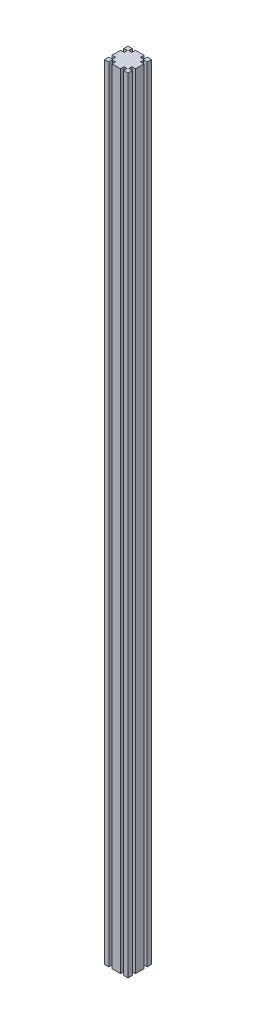
ISO-10303-21;
HEADER;
FILE_DESCRIPTION(('STEP AP214'),'2;1');
FILE_NAME('part.step','',(''),(''),'','','');
FILE_SCHEMA(('AUTOMOTIVE_DESIGN { 1 0 10303 214 1 1 1 1 }'));
ENDSEC;
DATA;
#1=APPLICATION_CONTEXT('core data for automotive mechanical design processes');
#2=APPLICATION_PROTOCOL_DEFINITION('international standard','automotive_design',2000,#1);
#3=PRODUCT_CONTEXT('',#1,'mechanical');
#4=PRODUCT('Part','Part','',(#3));
#5=PRODUCT_RELATED_PRODUCT_CATEGORY('part','',(#4));
#6=PRODUCT_DEFINITION_FORMATION('','',#4);
#7=PRODUCT_DEFINITION_CONTEXT('part definition',#1,'design');
#8=PRODUCT_DEFINITION('design','',#6,#7);
#9=PRODUCT_DEFINITION_SHAPE('','',#8);
#10=(LENGTH_UNIT() NAMED_UNIT(*) SI_UNIT(.MILLI.,.METRE.));
#11=(NAMED_UNIT(*) PLANE_ANGLE_UNIT() SI_UNIT($,.RADIAN.));
#12=(NAMED_UNIT(*) SI_UNIT($,.STERADIAN.) SOLID_ANGLE_UNIT());
#13=UNCERTAINTY_MEASURE_WITH_UNIT(LENGTH_MEASURE(1.E-05),#10,'distance_accuracy_value','');
#14=(GEOMETRIC_REPRESENTATION_CONTEXT(3) GLOBAL_UNCERTAINTY_ASSIGNED_CONTEXT((#13)) GLOBAL_UNIT_ASSIGNED_CONTEXT((#10,
#11,#12)) REPRESENTATION_CONTEXT('',''));
#15=CARTESIAN_POINT('',(0.,0.,0.));
#16=DIRECTION('',(0.,0.,1.));
#17=DIRECTION('',(1.,0.,0.));
#18=AXIS2_PLACEMENT_3D('',#15,#16,#17);
#19=CARTESIAN_POINT('',(0.,2000.,0.));
#20=DIRECTION('',(-1.,0.,0.));
#21=DIRECTION('',(0.,0.,1.));
#22=AXIS2_PLACEMENT_3D('',#19,#20,#21);
#23=PLANE('',#22);
#24=DIRECTION('',(0.,0.,-1.));
#25=VECTOR('',#24,1.);
#26=CARTESIAN_POINT('',(0.,0.,0.));
#27=LINE('',#26,#25);
#28=CARTESIAN_POINT('',(0.,0.,-19.1));
#29=VERTEX_POINT('',#28);
#30=CARTESIAN_POINT('',(0.,0.,-40.9));
#31=VERTEX_POINT('',#30);
#32=EDGE_CURVE('E307',#29,#31,#27,.T.);
#33=ORIENTED_EDGE('',*,*,#32,.F.);
#34=DIRECTION('',(0.,-1.,0.));
#35=VECTOR('',#34,1.);
#36=CARTESIAN_POINT('',(0.,2000.,-19.1));
#37=LINE('',#36,#35);
#38=CARTESIAN_POINT('',(0.,2000.,-19.1));
#39=VERTEX_POINT('',#38);
#40=EDGE_CURVE('E11',#39,#29,#37,.T.);
#41=ORIENTED_EDGE('',*,*,#40,.F.);
#42=DIRECTION('',(0.,0.,-1.));
#43=VECTOR('',#42,1.);
#44=CARTESIAN_POINT('',(0.,2000.,0.));
#45=LINE('',#44,#43);
#46=CARTESIAN_POINT('',(0.,2000.,-40.9));
#47=VERTEX_POINT('',#46);
#48=EDGE_CURVE('E427',#39,#47,#45,.T.);
#49=ORIENTED_EDGE('',*,*,#48,.T.);
#50=DIRECTION('',(0.,-1.,0.));
#51=VECTOR('',#50,1.);
#52=CARTESIAN_POINT('',(0.,2000.,-40.9));
#53=LINE('',#52,#51);
#54=EDGE_CURVE('E178',#47,#31,#53,.T.);
#55=ORIENTED_EDGE('',*,*,#54,.T.);
#56=EDGE_LOOP('',(#33,#41,#49,#55));
#57=FACE_BOUND('',#56,.T.);
#58=ADVANCED_FACE('F41',(#57),#23,.T.);
#59=CARTESIAN_POINT('',(0.,2000.,-19.1));
#60=DIRECTION('',(0.,0.,1.));
#61=DIRECTION('',(1.,0.,0.));
#62=AXIS2_PLACEMENT_3D('',#59,#60,#61);
#63=PLANE('',#62);
#64=DIRECTION('',(-1.,0.,0.));
#65=VECTOR('',#64,1.);
#66=CARTESIAN_POINT('',(0.,0.,-19.1));
#67=LINE('',#66,#65);
#68=CARTESIAN_POINT('',(9.2,0.,-19.1));
#69=VERTEX_POINT('',#68);
#70=EDGE_CURVE('E311',#69,#29,#67,.T.);
#71=ORIENTED_EDGE('',*,*,#70,.F.);
#72=DIRECTION('',(0.,-1.,0.));
#73=VECTOR('',#72,1.);
#74=CARTESIAN_POINT('',(9.2,2000.,-19.1));
#75=LINE('',#74,#73);
#76=CARTESIAN_POINT('',(9.2,2000.,-19.1));
#77=VERTEX_POINT('',#76);
#78=EDGE_CURVE('E51',#77,#69,#75,.T.);
#79=ORIENTED_EDGE('',*,*,#78,.F.);
#80=DIRECTION('',(-1.,0.,0.));
#81=VECTOR('',#80,1.);
#82=CARTESIAN_POINT('',(0.,2000.,-19.1));
#83=LINE('',#82,#81);
#84=EDGE_CURVE('E557',#77,#39,#83,.T.);
#85=ORIENTED_EDGE('',*,*,#84,.T.);
#86=ORIENTED_EDGE('',*,*,#40,.T.);
#87=EDGE_LOOP('',(#71,#79,#85,#86));
#88=FACE_BOUND('',#87,.T.);
#89=ADVANCED_FACE('F43',(#88),#63,.T.);
#90=CARTESIAN_POINT('',(9.2,2000.,0.));
#91=DIRECTION('',(-1.,0.,0.));
#92=DIRECTION('',(0.,0.,1.));
#93=AXIS2_PLACEMENT_3D('',#90,#91,#92);
#94=PLANE('',#93);
#95=DIRECTION('',(0.,0.,-1.));
#96=VECTOR('',#95,1.);
#97=CARTESIAN_POINT('',(9.2,0.,0.));
#98=LINE('',#97,#96);
#99=CARTESIAN_POINT('',(9.2,0.,-10.9));
#100=VERTEX_POINT('',#99);
#101=EDGE_CURVE('E316',#100,#69,#98,.T.);
#102=ORIENTED_EDGE('',*,*,#101,.F.);
#103=DIRECTION('',(0.,-1.,0.));
#104=VECTOR('',#103,1.);
#105=CARTESIAN_POINT('',(9.2,2000.,-10.9));
#106=LINE('',#105,#104);
#107=CARTESIAN_POINT('',(9.2,2000.,-10.9));
#108=VERTEX_POINT('',#107);
#109=EDGE_CURVE('E532',#108,#100,#106,.T.);
#110=ORIENTED_EDGE('',*,*,#109,.F.);
#111=DIRECTION('',(0.,0.,-1.));
#112=VECTOR('',#111,1.);
#113=CARTESIAN_POINT('',(9.2,2000.,0.));
#114=LINE('',#113,#112);
#115=EDGE_CURVE('E541',#108,#77,#114,.T.);
#116=ORIENTED_EDGE('',*,*,#115,.T.);
#117=ORIENTED_EDGE('',*,*,#78,.T.);
#118=EDGE_LOOP('',(#102,#110,#116,#117));
#119=FACE_BOUND('',#118,.T.);
#120=ADVANCED_FACE('F539',(#119),#94,.T.);
#121=CARTESIAN_POINT('',(0.,2000.,-10.9));
#122=DIRECTION('',(0.,0.,-1.));
#123=DIRECTION('',(-1.,0.,0.));
#124=AXIS2_PLACEMENT_3D('',#121,#122,#123);
#125=PLANE('',#124);
#126=DIRECTION('',(1.,0.,0.));
#127=VECTOR('',#126,1.);
#128=CARTESIAN_POINT('',(0.,0.,-10.9));
#129=LINE('',#128,#127);
#130=CARTESIAN_POINT('',(0.,0.,-10.9));
#131=VERTEX_POINT('',#130);
#132=EDGE_CURVE('E320',#131,#100,#129,.T.);
#133=ORIENTED_EDGE('',*,*,#132,.F.);
#134=DIRECTION('',(0.,-1.,0.));
#135=VECTOR('',#134,1.);
#136=CARTESIAN_POINT('',(0.,2000.,-10.9));
#137=LINE('',#136,#135);
#138=CARTESIAN_POINT('',(0.,2000.,-10.9));
#139=VERTEX_POINT('',#138);
#140=EDGE_CURVE('E529',#139,#131,#137,.T.);
#141=ORIENTED_EDGE('',*,*,#140,.F.);
#142=DIRECTION('',(1.,0.,0.));
#143=VECTOR('',#142,1.);
#144=CARTESIAN_POINT('',(0.,2000.,-10.9));
#145=LINE('',#144,#143);
#146=EDGE_CURVE('E554',#139,#108,#145,.T.);
#147=ORIENTED_EDGE('',*,*,#146,.T.);
#148=ORIENTED_EDGE('',*,*,#109,.T.);
#149=EDGE_LOOP('',(#133,#141,#147,#148));
#150=FACE_BOUND('',#149,.T.);
#151=ADVANCED_FACE('F551',(#150),#125,.T.);
#152=CARTESIAN_POINT('',(0.,2000.,0.));
#153=DIRECTION('',(-1.,0.,0.));
#154=DIRECTION('',(0.,0.,1.));
#155=AXIS2_PLACEMENT_3D('',#152,#153,#154);
#156=PLANE('',#155);
#157=DIRECTION('',(0.,0.,-1.));
#158=VECTOR('',#157,1.);
#159=CARTESIAN_POINT('',(0.,0.,0.));
#160=LINE('',#159,#158);
#161=CARTESIAN_POINT('',(0.,0.,0.));
#162=VERTEX_POINT('',#161);
#163=EDGE_CURVE('E324',#162,#131,#160,.T.);
#164=ORIENTED_EDGE('',*,*,#163,.F.);
#165=DIRECTION('',(0.,-1.,0.));
#166=VECTOR('',#165,1.);
#167=CARTESIAN_POINT('',(0.,2000.,0.));
#168=LINE('',#167,#166);
#169=CARTESIAN_POINT('',(0.,2000.,0.));
#170=VERTEX_POINT('',#169);
#171=EDGE_CURVE('E526',#170,#162,#168,.T.);
#172=ORIENTED_EDGE('',*,*,#171,.F.);
#173=DIRECTION('',(0.,0.,-1.));
#174=VECTOR('',#173,1.);
#175=CARTESIAN_POINT('',(0.,2000.,0.));
#176=LINE('',#175,#174);
#177=EDGE_CURVE('E562',#170,#139,#176,.T.);
#178=ORIENTED_EDGE('',*,*,#177,.T.);
#179=ORIENTED_EDGE('',*,*,#140,.T.);
#180=EDGE_LOOP('',(#164,#172,#178,#179));
#181=FACE_BOUND('',#180,.T.);
#182=ADVANCED_FACE('F813',(#181),#156,.T.);
#183=CARTESIAN_POINT('',(0.,2000.,0.));
#184=DIRECTION('',(0.,0.,-1.));
#185=DIRECTION('',(-1.,0.,0.));
#186=AXIS2_PLACEMENT_3D('',#183,#184,#185);
#187=PLANE('',#186);
#188=DIRECTION('',(1.,0.,0.));
#189=VECTOR('',#188,1.);
#190=CARTESIAN_POINT('',(0.,0.,0.));
#191=LINE('',#190,#189);
#192=CARTESIAN_POINT('',(10.9,0.,0.));
#193=VERTEX_POINT('',#192);
#194=EDGE_CURVE('E328',#162,#193,#191,.T.);
#195=ORIENTED_EDGE('',*,*,#194,.T.);
#196=DIRECTION('',(0.,-1.,0.));
#197=VECTOR('',#196,1.);
#198=CARTESIAN_POINT('',(10.9,2000.,0.));
#199=LINE('',#198,#197);
#200=CARTESIAN_POINT('',(10.9,2000.,0.));
#201=VERTEX_POINT('',#200);
#202=EDGE_CURVE('E522',#201,#193,#199,.T.);
#203=ORIENTED_EDGE('',*,*,#202,.F.);
#204=DIRECTION('',(1.,0.,0.));
#205=VECTOR('',#204,1.);
#206=CARTESIAN_POINT('',(0.,2000.,0.));
#207=LINE('',#206,#205);
#208=EDGE_CURVE('E569',#170,#201,#207,.T.);
#209=ORIENTED_EDGE('',*,*,#208,.F.);
#210=ORIENTED_EDGE('',*,*,#171,.T.);
#211=EDGE_LOOP('',(#195,#203,#209,#210));
#212=FACE_BOUND('',#211,.T.);
#213=ADVANCED_FACE('F809',(#212),#187,.F.);
#214=CARTESIAN_POINT('',(10.9,2000.,0.));
#215=DIRECTION('',(-1.,0.,0.));
#216=DIRECTION('',(0.,0.,1.));
#217=AXIS2_PLACEMENT_3D('',#214,#215,#216);
#218=PLANE('',#217);
#219=DIRECTION('',(0.,0.,-1.));
#220=VECTOR('',#219,1.);
#221=CARTESIAN_POINT('',(10.9,0.,0.));
#222=LINE('',#221,#220);
#223=CARTESIAN_POINT('',(10.9,0.,-9.2));
#224=VERTEX_POINT('',#223);
#225=EDGE_CURVE('E331',#193,#224,#222,.T.);
#226=ORIENTED_EDGE('',*,*,#225,.T.);
#227=DIRECTION('',(0.,-1.,0.));
#228=VECTOR('',#227,1.);
#229=CARTESIAN_POINT('',(10.9,2000.,-9.2));
#230=LINE('',#229,#228);
#231=CARTESIAN_POINT('',(10.9,2000.,-9.2));
#232=VERTEX_POINT('',#231);
#233=EDGE_CURVE('E518',#232,#224,#230,.T.);
#234=ORIENTED_EDGE('',*,*,#233,.F.);
#235=DIRECTION('',(0.,0.,-1.));
#236=VECTOR('',#235,1.);
#237=CARTESIAN_POINT('',(10.9,2000.,0.));
#238=LINE('',#237,#236);
#239=EDGE_CURVE('E572',#201,#232,#238,.T.);
#240=ORIENTED_EDGE('',*,*,#239,.F.);
#241=ORIENTED_EDGE('',*,*,#202,.T.);
#242=EDGE_LOOP('',(#226,#234,#240,#241));
#243=FACE_BOUND('',#242,.T.);
#244=ADVANCED_FACE('F805',(#243),#218,.F.);
#245=CARTESIAN_POINT('',(0.,2000.,-9.19999999999999));
#246=DIRECTION('',(0.,0.,-1.));
#247=DIRECTION('',(-1.,0.,0.));
#248=AXIS2_PLACEMENT_3D('',#245,#246,#247);
#249=PLANE('',#248);
#250=DIRECTION('',(1.,0.,0.));
#251=VECTOR('',#250,1.);
#252=CARTESIAN_POINT('',(0.,0.,-9.19999999999999));
#253=LINE('',#252,#251);
#254=CARTESIAN_POINT('',(19.1,0.,-9.20000000000001));
#255=VERTEX_POINT('',#254);
#256=EDGE_CURVE('E334',#224,#255,#253,.T.);
#257=ORIENTED_EDGE('',*,*,#256,.T.);
#258=DIRECTION('',(0.,-1.,0.));
#259=VECTOR('',#258,1.);
#260=CARTESIAN_POINT('',(19.1,2000.,-9.20000000000001));
#261=LINE('',#260,#259);
#262=CARTESIAN_POINT('',(19.1,2000.,-9.20000000000001));
#263=VERTEX_POINT('',#262);
#264=EDGE_CURVE('E514',#263,#255,#261,.T.);
#265=ORIENTED_EDGE('',*,*,#264,.F.);
#266=DIRECTION('',(1.,0.,0.));
#267=VECTOR('',#266,1.);
#268=CARTESIAN_POINT('',(0.,2000.,-9.19999999999999));
#269=LINE('',#268,#267);
#270=EDGE_CURVE('E575',#232,#263,#269,.T.);
#271=ORIENTED_EDGE('',*,*,#270,.F.);
#272=ORIENTED_EDGE('',*,*,#233,.T.);
#273=EDGE_LOOP('',(#257,#265,#271,#272));
#274=FACE_BOUND('',#273,.T.);
#275=ADVANCED_FACE('F801',(#274),#249,.F.);
#276=CARTESIAN_POINT('',(19.1,2000.,0.));
#277=DIRECTION('',(1.,0.,0.));
#278=DIRECTION('',(0.,0.,-1.));
#279=AXIS2_PLACEMENT_3D('',#276,#277,#278);
#280=PLANE('',#279);
#281=DIRECTION('',(0.,0.,1.));
#282=VECTOR('',#281,1.);
#283=CARTESIAN_POINT('',(19.1,0.,0.));
#284=LINE('',#283,#282);
#285=CARTESIAN_POINT('',(19.1,0.,0.));
#286=VERTEX_POINT('',#285);
#287=EDGE_CURVE('E337',#255,#286,#284,.T.);
#288=ORIENTED_EDGE('',*,*,#287,.T.);
#289=DIRECTION('',(0.,-1.,0.));
#290=VECTOR('',#289,1.);
#291=CARTESIAN_POINT('',(19.1,2000.,0.));
#292=LINE('',#291,#290);
#293=CARTESIAN_POINT('',(19.1,2000.,0.));
#294=VERTEX_POINT('',#293);
#295=EDGE_CURVE('E510',#294,#286,#292,.T.);
#296=ORIENTED_EDGE('',*,*,#295,.F.);
#297=DIRECTION('',(0.,0.,1.));
#298=VECTOR('',#297,1.);
#299=CARTESIAN_POINT('',(19.1,2000.,0.));
#300=LINE('',#299,#298);
#301=EDGE_CURVE('E578',#263,#294,#300,.T.);
#302=ORIENTED_EDGE('',*,*,#301,.F.);
#303=ORIENTED_EDGE('',*,*,#264,.T.);
#304=EDGE_LOOP('',(#288,#296,#302,#303));
#305=FACE_BOUND('',#304,.T.);
#306=ADVANCED_FACE('F798',(#305),#280,.F.);
#307=CARTESIAN_POINT('',(0.,2000.,0.));
#308=DIRECTION('',(0.,0.,-1.));
#309=DIRECTION('',(-1.,0.,0.));
#310=AXIS2_PLACEMENT_3D('',#307,#308,#309);
#311=PLANE('',#310);
#312=DIRECTION('',(1.,0.,0.));
#313=VECTOR('',#312,1.);
#314=CARTESIAN_POINT('',(0.,0.,0.));
#315=LINE('',#314,#313);
#316=CARTESIAN_POINT('',(40.9,0.,0.));
#317=VERTEX_POINT('',#316);
#318=EDGE_CURVE('E340',#286,#317,#315,.T.);
#319=ORIENTED_EDGE('',*,*,#318,.T.);
#320=DIRECTION('',(0.,-1.,0.));
#321=VECTOR('',#320,1.);
#322=CARTESIAN_POINT('',(40.9,2000.,0.));
#323=LINE('',#322,#321);
#324=CARTESIAN_POINT('',(40.9,2000.,0.));
#325=VERTEX_POINT('',#324);
#326=EDGE_CURVE('E507',#325,#317,#323,.T.);
#327=ORIENTED_EDGE('',*,*,#326,.F.);
#328=DIRECTION('',(1.,0.,0.));
#329=VECTOR('',#328,1.);
#330=CARTESIAN_POINT('',(0.,2000.,0.));
#331=LINE('',#330,#329);
#332=EDGE_CURVE('E581',#294,#325,#331,.T.);
#333=ORIENTED_EDGE('',*,*,#332,.F.);
#334=ORIENTED_EDGE('',*,*,#295,.T.);
#335=EDGE_LOOP('',(#319,#327,#333,#334));
#336=FACE_BOUND('',#335,.T.);
#337=ADVANCED_FACE('F786',(#336),#311,.F.);
#338=CARTESIAN_POINT('',(40.9,2000.,0.));
#339=DIRECTION('',(1.,0.,0.));
#340=DIRECTION('',(0.,0.,-1.));
#341=AXIS2_PLACEMENT_3D('',#338,#339,#340);
#342=PLANE('',#341);
#343=DIRECTION('',(0.,0.,1.));
#344=VECTOR('',#343,1.);
#345=CARTESIAN_POINT('',(40.9,0.,0.));
#346=LINE('',#345,#344);
#347=CARTESIAN_POINT('',(40.9,0.,-9.20000000000001));
#348=VERTEX_POINT('',#347);
#349=EDGE_CURVE('E344',#348,#317,#346,.T.);
#350=ORIENTED_EDGE('',*,*,#349,.F.);
#351=DIRECTION('',(0.,-1.,0.));
#352=VECTOR('',#351,1.);
#353=CARTESIAN_POINT('',(40.9,2000.,-9.20000000000001));
#354=LINE('',#353,#352);
#355=CARTESIAN_POINT('',(40.9,2000.,-9.20000000000001));
#356=VERTEX_POINT('',#355);
#357=EDGE_CURVE('E504',#356,#348,#354,.T.);
#358=ORIENTED_EDGE('',*,*,#357,.F.);
#359=DIRECTION('',(0.,0.,1.));
#360=VECTOR('',#359,1.);
#361=CARTESIAN_POINT('',(40.9,2000.,0.));
#362=LINE('',#361,#360);
#363=EDGE_CURVE('E584',#356,#325,#362,.T.);
#364=ORIENTED_EDGE('',*,*,#363,.T.);
#365=ORIENTED_EDGE('',*,*,#326,.T.);
#366=EDGE_LOOP('',(#350,#358,#364,#365));
#367=FACE_BOUND('',#366,.T.);
#368=ADVANCED_FACE('F793',(#367),#342,.T.);
#369=CARTESIAN_POINT('',(0.,2000.,-9.19999999999997));
#370=DIRECTION('',(0.,0.,1.));
#371=DIRECTION('',(1.,0.,0.));
#372=AXIS2_PLACEMENT_3D('',#369,#370,#371);
#373=PLANE('',#372);
#374=DIRECTION('',(-1.,0.,0.));
#375=VECTOR('',#374,1.);
#376=CARTESIAN_POINT('',(0.,0.,-9.19999999999997));
#377=LINE('',#376,#375);
#378=CARTESIAN_POINT('',(49.1,0.,-9.20000000000001));
#379=VERTEX_POINT('',#378);
#380=EDGE_CURVE('E349',#379,#348,#377,.T.);
#381=ORIENTED_EDGE('',*,*,#380,.F.);
#382=DIRECTION('',(0.,-1.,0.));
#383=VECTOR('',#382,1.);
#384=CARTESIAN_POINT('',(49.1,2000.,-9.20000000000001));
#385=LINE('',#384,#383);
#386=CARTESIAN_POINT('',(49.1,2000.,-9.20000000000001));
#387=VERTEX_POINT('',#386);
#388=EDGE_CURVE('E501',#387,#379,#385,.T.);
#389=ORIENTED_EDGE('',*,*,#388,.F.);
#390=DIRECTION('',(-1.,0.,0.));
#391=VECTOR('',#390,1.);
#392=CARTESIAN_POINT('',(0.,2000.,-9.19999999999997));
#393=LINE('',#392,#391);
#394=EDGE_CURVE('E589',#387,#356,#393,.T.);
#395=ORIENTED_EDGE('',*,*,#394,.T.);
#396=ORIENTED_EDGE('',*,*,#357,.T.);
#397=EDGE_LOOP('',(#381,#389,#395,#396));
#398=FACE_BOUND('',#397,.T.);
#399=ADVANCED_FACE('F789',(#398),#373,.T.);
#400=CARTESIAN_POINT('',(49.1,2000.,0.));
#401=DIRECTION('',(-1.,0.,0.));
#402=DIRECTION('',(0.,0.,1.));
#403=AXIS2_PLACEMENT_3D('',#400,#401,#402);
#404=PLANE('',#403);
#405=DIRECTION('',(0.,0.,-1.));
#406=VECTOR('',#405,1.);
#407=CARTESIAN_POINT('',(49.1,0.,0.));
#408=LINE('',#407,#406);
#409=CARTESIAN_POINT('',(49.1,0.,0.));
#410=VERTEX_POINT('',#409);
#411=EDGE_CURVE('E353',#410,#379,#408,.T.);
#412=ORIENTED_EDGE('',*,*,#411,.F.);
#413=DIRECTION('',(0.,-1.,0.));
#414=VECTOR('',#413,1.);
#415=CARTESIAN_POINT('',(49.1,2000.,0.));
#416=LINE('',#415,#414);
#417=CARTESIAN_POINT('',(49.1,2000.,0.));
#418=VERTEX_POINT('',#417);
#419=EDGE_CURVE('E498',#418,#410,#416,.T.);
#420=ORIENTED_EDGE('',*,*,#419,.F.);
#421=DIRECTION('',(0.,0.,-1.));
#422=VECTOR('',#421,1.);
#423=CARTESIAN_POINT('',(49.1,2000.,0.));
#424=LINE('',#423,#422);
#425=EDGE_CURVE('E593',#418,#387,#424,.T.);
#426=ORIENTED_EDGE('',*,*,#425,.T.);
#427=ORIENTED_EDGE('',*,*,#388,.T.);
#428=EDGE_LOOP('',(#412,#420,#426,#427));
#429=FACE_BOUND('',#428,.T.);
#430=ADVANCED_FACE('F785',(#429),#404,.T.);
#431=CARTESIAN_POINT('',(60.,0.,0.));
#432=VERTEX_POINT('',#431);
#433=EDGE_CURVE('E345',#410,#432,#315,.T.);
#434=ORIENTED_EDGE('',*,*,#433,.T.);
#435=DIRECTION('',(0.,-1.,0.));
#436=VECTOR('',#435,1.);
#437=CARTESIAN_POINT('',(60.,2000.,0.));
#438=LINE('',#437,#436);
#439=CARTESIAN_POINT('',(60.,2000.,0.));
#440=VERTEX_POINT('',#439);
#441=EDGE_CURVE('E494',#440,#432,#438,.T.);
#442=ORIENTED_EDGE('',*,*,#441,.F.);
#443=EDGE_CURVE('E585',#418,#440,#331,.T.);
#444=ORIENTED_EDGE('',*,*,#443,.F.);
#445=ORIENTED_EDGE('',*,*,#419,.T.);
#446=EDGE_LOOP('',(#434,#442,#444,#445));
#447=FACE_BOUND('',#446,.T.);
#448=ADVANCED_FACE('F685',(#447),#311,.F.);
#449=CARTESIAN_POINT('',(60.,2000.,0.));
#450=DIRECTION('',(-1.,0.,0.));
#451=DIRECTION('',(0.,0.,1.));
#452=AXIS2_PLACEMENT_3D('',#449,#450,#451);
#453=PLANE('',#452);
#454=DIRECTION('',(0.,0.,-1.));
#455=VECTOR('',#454,1.);
#456=CARTESIAN_POINT('',(60.,0.,0.));
#457=LINE('',#456,#455);
#458=CARTESIAN_POINT('',(60.,0.,-10.9));
#459=VERTEX_POINT('',#458);
#460=EDGE_CURVE('E357',#432,#459,#457,.T.);
#461=ORIENTED_EDGE('',*,*,#460,.T.);
#462=DIRECTION('',(0.,-1.,0.));
#463=VECTOR('',#462,1.);
#464=CARTESIAN_POINT('',(60.,2000.,-10.9));
#465=LINE('',#464,#463);
#466=CARTESIAN_POINT('',(60.,2000.,-10.9));
#467=VERTEX_POINT('',#466);
#468=EDGE_CURVE('E490',#467,#459,#465,.T.);
#469=ORIENTED_EDGE('',*,*,#468,.F.);
#470=DIRECTION('',(0.,0.,-1.));
#471=VECTOR('',#470,1.);
#472=CARTESIAN_POINT('',(60.,2000.,0.));
#473=LINE('',#472,#471);
#474=EDGE_CURVE('E597',#440,#467,#473,.T.);
#475=ORIENTED_EDGE('',*,*,#474,.F.);
#476=ORIENTED_EDGE('',*,*,#441,.T.);
#477=EDGE_LOOP('',(#461,#469,#475,#476));
#478=FACE_BOUND('',#477,.T.);
#479=ADVANCED_FACE('F691',(#478),#453,.F.);
#480=CARTESIAN_POINT('',(0.,2000.,-10.9));
#481=DIRECTION('',(0.,0.,1.));
#482=DIRECTION('',(1.,0.,0.));
#483=AXIS2_PLACEMENT_3D('',#480,#481,#482);
#484=PLANE('',#483);
#485=DIRECTION('',(-1.,0.,0.));
#486=VECTOR('',#485,1.);
#487=CARTESIAN_POINT('',(0.,0.,-10.9));
#488=LINE('',#487,#486);
#489=CARTESIAN_POINT('',(50.8,0.,-10.9));
#490=VERTEX_POINT('',#489);
#491=EDGE_CURVE('E360',#459,#490,#488,.T.);
#492=ORIENTED_EDGE('',*,*,#491,.T.);
#493=DIRECTION('',(0.,-1.,0.));
#494=VECTOR('',#493,1.);
#495=CARTESIAN_POINT('',(50.8,2000.,-10.9));
#496=LINE('',#495,#494);
#497=CARTESIAN_POINT('',(50.8,2000.,-10.9));
#498=VERTEX_POINT('',#497);
#499=EDGE_CURVE('E486',#498,#490,#496,.T.);
#500=ORIENTED_EDGE('',*,*,#499,.F.);
#501=DIRECTION('',(-1.,0.,0.));
#502=VECTOR('',#501,1.);
#503=CARTESIAN_POINT('',(0.,2000.,-10.9));
#504=LINE('',#503,#502);
#505=EDGE_CURVE('E600',#467,#498,#504,.T.);
#506=ORIENTED_EDGE('',*,*,#505,.F.);
#507=ORIENTED_EDGE('',*,*,#468,.T.);
#508=EDGE_LOOP('',(#492,#500,#506,#507));
#509=FACE_BOUND('',#508,.T.);
#510=ADVANCED_FACE('F698',(#509),#484,.F.);
#511=CARTESIAN_POINT('',(50.8,2000.,0.));
#512=DIRECTION('',(-1.,0.,0.));
#513=DIRECTION('',(0.,0.,1.));
#514=AXIS2_PLACEMENT_3D('',#511,#512,#513);
#515=PLANE('',#514);
#516=DIRECTION('',(0.,0.,-1.));
#517=VECTOR('',#516,1.);
#518=CARTESIAN_POINT('',(50.8,0.,0.));
#519=LINE('',#518,#517);
#520=CARTESIAN_POINT('',(50.8,0.,-19.1));
#521=VERTEX_POINT('',#520);
#522=EDGE_CURVE('E363',#490,#521,#519,.T.);
#523=ORIENTED_EDGE('',*,*,#522,.T.);
#524=DIRECTION('',(0.,-1.,0.));
#525=VECTOR('',#524,1.);
#526=CARTESIAN_POINT('',(50.8,2000.,-19.1));
#527=LINE('',#526,#525);
#528=CARTESIAN_POINT('',(50.8,2000.,-19.1));
#529=VERTEX_POINT('',#528);
#530=EDGE_CURVE('E482',#529,#521,#527,.T.);
#531=ORIENTED_EDGE('',*,*,#530,.F.);
#532=DIRECTION('',(0.,0.,-1.));
#533=VECTOR('',#532,1.);
#534=CARTESIAN_POINT('',(50.8,2000.,0.));
#535=LINE('',#534,#533);
#536=EDGE_CURVE('E603',#498,#529,#535,.T.);
#537=ORIENTED_EDGE('',*,*,#536,.F.);
#538=ORIENTED_EDGE('',*,*,#499,.T.);
#539=EDGE_LOOP('',(#523,#531,#537,#538));
#540=FACE_BOUND('',#539,.T.);
#541=ADVANCED_FACE('F702',(#540),#515,.F.);
#542=CARTESIAN_POINT('',(0.,2000.,-19.1));
#543=DIRECTION('',(0.,0.,-1.));
#544=DIRECTION('',(-1.,0.,0.));
#545=AXIS2_PLACEMENT_3D('',#542,#543,#544);
#546=PLANE('',#545);
#547=DIRECTION('',(1.,0.,0.));
#548=VECTOR('',#547,1.);
#549=CARTESIAN_POINT('',(0.,0.,-19.1));
#550=LINE('',#549,#548);
#551=CARTESIAN_POINT('',(60.,0.,-19.1));
#552=VERTEX_POINT('',#551);
#553=EDGE_CURVE('E366',#521,#552,#550,.T.);
#554=ORIENTED_EDGE('',*,*,#553,.T.);
#555=DIRECTION('',(0.,-1.,0.));
#556=VECTOR('',#555,1.);
#557=CARTESIAN_POINT('',(60.,2000.,-19.1));
#558=LINE('',#557,#556);
#559=CARTESIAN_POINT('',(60.,2000.,-19.1));
#560=VERTEX_POINT('',#559);
#561=EDGE_CURVE('E478',#560,#552,#558,.T.);
#562=ORIENTED_EDGE('',*,*,#561,.F.);
#563=DIRECTION('',(1.,0.,0.));
#564=VECTOR('',#563,1.);
#565=CARTESIAN_POINT('',(0.,2000.,-19.1));
#566=LINE('',#565,#564);
#567=EDGE_CURVE('E606',#529,#560,#566,.T.);
#568=ORIENTED_EDGE('',*,*,#567,.F.);
#569=ORIENTED_EDGE('',*,*,#530,.T.);
#570=EDGE_LOOP('',(#554,#562,#568,#569));
#571=FACE_BOUND('',#570,.T.);
#572=ADVANCED_FACE('F767',(#571),#546,.F.);
#573=CARTESIAN_POINT('',(60.,2000.,0.));
#574=DIRECTION('',(-1.,0.,0.));
#575=DIRECTION('',(0.,0.,1.));
#576=AXIS2_PLACEMENT_3D('',#573,#574,#575);
#577=PLANE('',#576);
#578=DIRECTION('',(0.,0.,-1.));
#579=VECTOR('',#578,1.);
#580=CARTESIAN_POINT('',(60.,0.,0.));
#581=LINE('',#580,#579);
#582=CARTESIAN_POINT('',(60.,0.,-40.9));
#583=VERTEX_POINT('',#582);
#584=EDGE_CURVE('E369',#552,#583,#581,.T.);
#585=ORIENTED_EDGE('',*,*,#584,.T.);
#586=DIRECTION('',(0.,-1.,0.));
#587=VECTOR('',#586,1.);
#588=CARTESIAN_POINT('',(60.,2000.,-40.9));
#589=LINE('',#588,#587);
#590=CARTESIAN_POINT('',(60.,2000.,-40.9));
#591=VERTEX_POINT('',#590);
#592=EDGE_CURVE('E475',#591,#583,#589,.T.);
#593=ORIENTED_EDGE('',*,*,#592,.F.);
#594=DIRECTION('',(0.,0.,-1.));
#595=VECTOR('',#594,1.);
#596=CARTESIAN_POINT('',(60.,2000.,0.));
#597=LINE('',#596,#595);
#598=EDGE_CURVE('E609',#560,#591,#597,.T.);
#599=ORIENTED_EDGE('',*,*,#598,.F.);
#600=ORIENTED_EDGE('',*,*,#561,.T.);
#601=EDGE_LOOP('',(#585,#593,#599,#600));
#602=FACE_BOUND('',#601,.T.);
#603=ADVANCED_FACE('F765',(#602),#577,.F.);
#604=CARTESIAN_POINT('',(0.,2000.,-40.9));
#605=DIRECTION('',(0.,0.,-1.));
#606=DIRECTION('',(-1.,0.,0.));
#607=AXIS2_PLACEMENT_3D('',#604,#605,#606);
#608=PLANE('',#607);
#609=DIRECTION('',(1.,0.,0.));
#610=VECTOR('',#609,1.);
#611=CARTESIAN_POINT('',(0.,0.,-40.9));
#612=LINE('',#611,#610);
#613=CARTESIAN_POINT('',(50.8,0.,-40.9));
#614=VERTEX_POINT('',#613);
#615=EDGE_CURVE('E373',#614,#583,#612,.T.);
#616=ORIENTED_EDGE('',*,*,#615,.F.);
#617=DIRECTION('',(0.,-1.,0.));
#618=VECTOR('',#617,1.);
#619=CARTESIAN_POINT('',(50.8,2000.,-40.9));
#620=LINE('',#619,#618);
#621=CARTESIAN_POINT('',(50.8,2000.,-40.9));
#622=VERTEX_POINT('',#621);
#623=EDGE_CURVE('E472',#622,#614,#620,.T.);
#624=ORIENTED_EDGE('',*,*,#623,.F.);
#625=DIRECTION('',(1.,0.,0.));
#626=VECTOR('',#625,1.);
#627=CARTESIAN_POINT('',(0.,2000.,-40.9));
#628=LINE('',#627,#626);
#629=EDGE_CURVE('E612',#622,#591,#628,.T.);
#630=ORIENTED_EDGE('',*,*,#629,.T.);
#631=ORIENTED_EDGE('',*,*,#592,.T.);
#632=EDGE_LOOP('',(#616,#624,#630,#631));
#633=FACE_BOUND('',#632,.T.);
#634=ADVANCED_FACE('F760',(#633),#608,.T.);
#635=CARTESIAN_POINT('',(50.7999999999999,2000.,0.));
#636=DIRECTION('',(1.,0.,0.));
#637=DIRECTION('',(0.,0.,-1.));
#638=AXIS2_PLACEMENT_3D('',#635,#636,#637);
#639=PLANE('',#638);
#640=DIRECTION('',(0.,0.,1.));
#641=VECTOR('',#640,1.);
#642=CARTESIAN_POINT('',(50.7999999999999,0.,0.));
#643=LINE('',#642,#641);
#644=CARTESIAN_POINT('',(50.8,0.,-49.1));
#645=VERTEX_POINT('',#644);
#646=EDGE_CURVE('E378',#645,#614,#643,.T.);
#647=ORIENTED_EDGE('',*,*,#646,.F.);
#648=DIRECTION('',(0.,-1.,0.));
#649=VECTOR('',#648,1.);
#650=CARTESIAN_POINT('',(50.8,2000.,-49.1));
#651=LINE('',#650,#649);
#652=CARTESIAN_POINT('',(50.8,2000.,-49.1));
#653=VERTEX_POINT('',#652);
#654=EDGE_CURVE('E469',#653,#645,#651,.T.);
#655=ORIENTED_EDGE('',*,*,#654,.F.);
#656=DIRECTION('',(0.,0.,1.));
#657=VECTOR('',#656,1.);
#658=CARTESIAN_POINT('',(50.7999999999999,2000.,0.));
#659=LINE('',#658,#657);
#660=EDGE_CURVE('E617',#653,#622,#659,.T.);
#661=ORIENTED_EDGE('',*,*,#660,.T.);
#662=ORIENTED_EDGE('',*,*,#623,.T.);
#663=EDGE_LOOP('',(#647,#655,#661,#662));
#664=FACE_BOUND('',#663,.T.);
#665=ADVANCED_FACE('F756',(#664),#639,.T.);
#666=CARTESIAN_POINT('',(0.,2000.,-49.1));
#667=DIRECTION('',(0.,0.,1.));
#668=DIRECTION('',(1.,0.,0.));
#669=AXIS2_PLACEMENT_3D('',#666,#667,#668);
#670=PLANE('',#669);
#671=DIRECTION('',(-1.,0.,0.));
#672=VECTOR('',#671,1.);
#673=CARTESIAN_POINT('',(0.,0.,-49.1));
#674=LINE('',#673,#672);
#675=CARTESIAN_POINT('',(60.,0.,-49.1));
#676=VERTEX_POINT('',#675);
#677=EDGE_CURVE('E382',#676,#645,#674,.T.);
#678=ORIENTED_EDGE('',*,*,#677,.F.);
#679=DIRECTION('',(0.,-1.,0.));
#680=VECTOR('',#679,1.);
#681=CARTESIAN_POINT('',(60.,2000.,-49.1));
#682=LINE('',#681,#680);
#683=CARTESIAN_POINT('',(60.,2000.,-49.1));
#684=VERTEX_POINT('',#683);
#685=EDGE_CURVE('E466',#684,#676,#682,.T.);
#686=ORIENTED_EDGE('',*,*,#685,.F.);
#687=DIRECTION('',(-1.,0.,0.));
#688=VECTOR('',#687,1.);
#689=CARTESIAN_POINT('',(0.,2000.,-49.1));
#690=LINE('',#689,#688);
#691=EDGE_CURVE('E621',#684,#653,#690,.T.);
#692=ORIENTED_EDGE('',*,*,#691,.T.);
#693=ORIENTED_EDGE('',*,*,#654,.T.);
#694=EDGE_LOOP('',(#678,#686,#692,#693));
#695=FACE_BOUND('',#694,.T.);
#696=ADVANCED_FACE('F753',(#695),#670,.T.);
#697=CARTESIAN_POINT('',(60.,0.,-60.));
#698=VERTEX_POINT('',#697);
#699=EDGE_CURVE('E374',#676,#698,#581,.T.);
#700=ORIENTED_EDGE('',*,*,#699,.T.);
#701=DIRECTION('',(0.,-1.,0.));
#702=VECTOR('',#701,1.);
#703=CARTESIAN_POINT('',(60.,2000.,-60.));
#704=LINE('',#703,#702);
#705=CARTESIAN_POINT('',(60.,2000.,-60.));
#706=VERTEX_POINT('',#705);
#707=EDGE_CURVE('E463',#706,#698,#704,.T.);
#708=ORIENTED_EDGE('',*,*,#707,.F.);
#709=EDGE_CURVE('E613',#684,#706,#597,.T.);
#710=ORIENTED_EDGE('',*,*,#709,.F.);
#711=ORIENTED_EDGE('',*,*,#685,.T.);
#712=EDGE_LOOP('',(#700,#708,#710,#711));
#713=FACE_BOUND('',#712,.T.);
#714=ADVANCED_FACE('F716',(#713),#577,.F.);
#715=CARTESIAN_POINT('',(0.,2000.,-60.));
#716=DIRECTION('',(0.,0.,-1.));
#717=DIRECTION('',(-1.,0.,0.));
#718=AXIS2_PLACEMENT_3D('',#715,#716,#717);
#719=PLANE('',#718);
#720=DIRECTION('',(1.,0.,0.));
#721=VECTOR('',#720,1.);
#722=CARTESIAN_POINT('',(0.,0.,-60.));
#723=LINE('',#722,#721);
#724=CARTESIAN_POINT('',(49.1,0.,-60.));
#725=VERTEX_POINT('',#724);
#726=EDGE_CURVE('E386',#725,#698,#723,.T.);
#727=ORIENTED_EDGE('',*,*,#726,.F.);
#728=DIRECTION('',(0.,-1.,0.));
#729=VECTOR('',#728,1.);
#730=CARTESIAN_POINT('',(49.1,2000.,-60.));
#731=LINE('',#730,#729);
#732=CARTESIAN_POINT('',(49.1,2000.,-60.));
#733=VERTEX_POINT('',#732);
#734=EDGE_CURVE('E460',#733,#725,#731,.T.);
#735=ORIENTED_EDGE('',*,*,#734,.F.);
#736=DIRECTION('',(1.,0.,0.));
#737=VECTOR('',#736,1.);
#738=CARTESIAN_POINT('',(0.,2000.,-60.));
#739=LINE('',#738,#737);
#740=EDGE_CURVE('E625',#733,#706,#739,.T.);
#741=ORIENTED_EDGE('',*,*,#740,.T.);
#742=ORIENTED_EDGE('',*,*,#707,.T.);
#743=EDGE_LOOP('',(#727,#735,#741,#742));
#744=FACE_BOUND('',#743,.T.);
#745=ADVANCED_FACE('F720',(#744),#719,.T.);
#746=CARTESIAN_POINT('',(49.1,2000.,0.));
#747=DIRECTION('',(1.,0.,0.));
#748=DIRECTION('',(0.,0.,-1.));
#749=AXIS2_PLACEMENT_3D('',#746,#747,#748);
#750=PLANE('',#749);
#751=DIRECTION('',(0.,0.,1.));
#752=VECTOR('',#751,1.);
#753=CARTESIAN_POINT('',(49.1,0.,0.));
#754=LINE('',#753,#752);
#755=CARTESIAN_POINT('',(49.1,0.,-50.8));
#756=VERTEX_POINT('',#755);
#757=EDGE_CURVE('E390',#725,#756,#754,.T.);
#758=ORIENTED_EDGE('',*,*,#757,.T.);
#759=DIRECTION('',(0.,-1.,0.));
#760=VECTOR('',#759,1.);
#761=CARTESIAN_POINT('',(49.1,2000.,-50.8));
#762=LINE('',#761,#760);
#763=CARTESIAN_POINT('',(49.1,2000.,-50.8));
#764=VERTEX_POINT('',#763);
#765=EDGE_CURVE('E456',#764,#756,#762,.T.);
#766=ORIENTED_EDGE('',*,*,#765,.F.);
#767=DIRECTION('',(0.,0.,1.));
#768=VECTOR('',#767,1.);
#769=CARTESIAN_POINT('',(49.1,2000.,0.));
#770=LINE('',#769,#768);
#771=EDGE_CURVE('E629',#733,#764,#770,.T.);
#772=ORIENTED_EDGE('',*,*,#771,.F.);
#773=ORIENTED_EDGE('',*,*,#734,.T.);
#774=EDGE_LOOP('',(#758,#766,#772,#773));
#775=FACE_BOUND('',#774,.T.);
#776=ADVANCED_FACE('F725',(#775),#750,.F.);
#777=CARTESIAN_POINT('',(0.,2000.,-50.8));
#778=DIRECTION('',(0.,0.,1.));
#779=DIRECTION('',(1.,0.,0.));
#780=AXIS2_PLACEMENT_3D('',#777,#778,#779);
#781=PLANE('',#780);
#782=DIRECTION('',(-1.,0.,0.));
#783=VECTOR('',#782,1.);
#784=CARTESIAN_POINT('',(0.,0.,-50.8));
#785=LINE('',#784,#783);
#786=CARTESIAN_POINT('',(40.9,0.,-50.8));
#787=VERTEX_POINT('',#786);
#788=EDGE_CURVE('E393',#756,#787,#785,.T.);
#789=ORIENTED_EDGE('',*,*,#788,.T.);
#790=DIRECTION('',(0.,-1.,0.));
#791=VECTOR('',#790,1.);
#792=CARTESIAN_POINT('',(40.9,2000.,-50.8));
#793=LINE('',#792,#791);
#794=CARTESIAN_POINT('',(40.9,2000.,-50.8));
#795=VERTEX_POINT('',#794);
#796=EDGE_CURVE('E452',#795,#787,#793,.T.);
#797=ORIENTED_EDGE('',*,*,#796,.F.);
#798=DIRECTION('',(-1.,0.,0.));
#799=VECTOR('',#798,1.);
#800=CARTESIAN_POINT('',(0.,2000.,-50.8));
#801=LINE('',#800,#799);
#802=EDGE_CURVE('E632',#764,#795,#801,.T.);
#803=ORIENTED_EDGE('',*,*,#802,.F.);
#804=ORIENTED_EDGE('',*,*,#765,.T.);
#805=EDGE_LOOP('',(#789,#797,#803,#804));
#806=FACE_BOUND('',#805,.T.);
#807=ADVANCED_FACE('F732',(#806),#781,.F.);
#808=CARTESIAN_POINT('',(40.9,2000.,0.));
#809=DIRECTION('',(-1.,0.,0.));
#810=DIRECTION('',(0.,0.,1.));
#811=AXIS2_PLACEMENT_3D('',#808,#809,#810);
#812=PLANE('',#811);
#813=DIRECTION('',(0.,0.,-1.));
#814=VECTOR('',#813,1.);
#815=CARTESIAN_POINT('',(40.9,0.,0.));
#816=LINE('',#815,#814);
#817=CARTESIAN_POINT('',(40.9,0.,-60.));
#818=VERTEX_POINT('',#817);
#819=EDGE_CURVE('E396',#787,#818,#816,.T.);
#820=ORIENTED_EDGE('',*,*,#819,.T.);
#821=DIRECTION('',(0.,-1.,0.));
#822=VECTOR('',#821,1.);
#823=CARTESIAN_POINT('',(40.9,2000.,-60.));
#824=LINE('',#823,#822);
#825=CARTESIAN_POINT('',(40.9,2000.,-60.));
#826=VERTEX_POINT('',#825);
#827=EDGE_CURVE('E449',#826,#818,#824,.T.);
#828=ORIENTED_EDGE('',*,*,#827,.F.);
#829=DIRECTION('',(0.,0.,-1.));
#830=VECTOR('',#829,1.);
#831=CARTESIAN_POINT('',(40.9,2000.,0.));
#832=LINE('',#831,#830);
#833=EDGE_CURVE('E635',#795,#826,#832,.T.);
#834=ORIENTED_EDGE('',*,*,#833,.F.);
#835=ORIENTED_EDGE('',*,*,#796,.T.);
#836=EDGE_LOOP('',(#820,#828,#834,#835));
#837=FACE_BOUND('',#836,.T.);
#838=ADVANCED_FACE('F736',(#837),#812,.F.);
#839=CARTESIAN_POINT('',(0.,2000.,-60.));
#840=DIRECTION('',(0.,0.,-1.));
#841=DIRECTION('',(-1.,0.,0.));
#842=AXIS2_PLACEMENT_3D('',#839,#840,#841);
#843=PLANE('',#842);
#844=DIRECTION('',(1.,0.,0.));
#845=VECTOR('',#844,1.);
#846=CARTESIAN_POINT('',(0.,0.,-60.));
#847=LINE('',#846,#845);
#848=CARTESIAN_POINT('',(19.1,0.,-60.));
#849=VERTEX_POINT('',#848);
#850=EDGE_CURVE('E400',#849,#818,#847,.T.);
#851=ORIENTED_EDGE('',*,*,#850,.F.);
#852=DIRECTION('',(0.,-1.,0.));
#853=VECTOR('',#852,1.);
#854=CARTESIAN_POINT('',(19.1,2000.,-60.));
#855=LINE('',#854,#853);
#856=CARTESIAN_POINT('',(19.1,2000.,-60.));
#857=VERTEX_POINT('',#856);
#858=EDGE_CURVE('E446',#857,#849,#855,.T.);
#859=ORIENTED_EDGE('',*,*,#858,.F.);
#860=DIRECTION('',(1.,0.,0.));
#861=VECTOR('',#860,1.);
#862=CARTESIAN_POINT('',(0.,2000.,-60.));
#863=LINE('',#862,#861);
#864=EDGE_CURVE('E638',#857,#826,#863,.T.);
#865=ORIENTED_EDGE('',*,*,#864,.T.);
#866=ORIENTED_EDGE('',*,*,#827,.T.);
#867=EDGE_LOOP('',(#851,#859,#865,#866));
#868=FACE_BOUND('',#867,.T.);
#869=ADVANCED_FACE('F739',(#868),#843,.T.);
#870=CARTESIAN_POINT('',(19.1,2000.,0.));
#871=DIRECTION('',(-1.,0.,0.));
#872=DIRECTION('',(0.,0.,1.));
#873=AXIS2_PLACEMENT_3D('',#870,#871,#872);
#874=PLANE('',#873);
#875=DIRECTION('',(0.,0.,-1.));
#876=VECTOR('',#875,1.);
#877=CARTESIAN_POINT('',(19.1,0.,0.));
#878=LINE('',#877,#876);
#879=CARTESIAN_POINT('',(19.1,0.,-50.8));
#880=VERTEX_POINT('',#879);
#881=EDGE_CURVE('E404',#880,#849,#878,.T.);
#882=ORIENTED_EDGE('',*,*,#881,.F.);
#883=DIRECTION('',(0.,-1.,0.));
#884=VECTOR('',#883,1.);
#885=CARTESIAN_POINT('',(19.1,2000.,-50.8));
#886=LINE('',#885,#884);
#887=CARTESIAN_POINT('',(19.1,2000.,-50.8));
#888=VERTEX_POINT('',#887);
#889=EDGE_CURVE('E443',#888,#880,#886,.T.);
#890=ORIENTED_EDGE('',*,*,#889,.F.);
#891=DIRECTION('',(0.,0.,-1.));
#892=VECTOR('',#891,1.);
#893=CARTESIAN_POINT('',(19.1,2000.,0.));
#894=LINE('',#893,#892);
#895=EDGE_CURVE('E642',#888,#857,#894,.T.);
#896=ORIENTED_EDGE('',*,*,#895,.T.);
#897=ORIENTED_EDGE('',*,*,#858,.T.);
#898=EDGE_LOOP('',(#882,#890,#896,#897));
#899=FACE_BOUND('',#898,.T.);
#900=ADVANCED_FACE('F744',(#899),#874,.T.);
#901=CARTESIAN_POINT('',(0.,2000.,-50.8));
#902=DIRECTION('',(0.,0.,-1.));
#903=DIRECTION('',(-1.,0.,0.));
#904=AXIS2_PLACEMENT_3D('',#901,#902,#903);
#905=PLANE('',#904);
#906=DIRECTION('',(1.,0.,0.));
#907=VECTOR('',#906,1.);
#908=CARTESIAN_POINT('',(0.,0.,-50.8));
#909=LINE('',#908,#907);
#910=CARTESIAN_POINT('',(10.9,0.,-50.8));
#911=VERTEX_POINT('',#910);
#912=EDGE_CURVE('E408',#911,#880,#909,.T.);
#913=ORIENTED_EDGE('',*,*,#912,.F.);
#914=DIRECTION('',(0.,-1.,0.));
#915=VECTOR('',#914,1.);
#916=CARTESIAN_POINT('',(10.9,2000.,-50.8));
#917=LINE('',#916,#915);
#918=CARTESIAN_POINT('',(10.9,2000.,-50.8));
#919=VERTEX_POINT('',#918);
#920=EDGE_CURVE('E440',#919,#911,#917,.T.);
#921=ORIENTED_EDGE('',*,*,#920,.F.);
#922=DIRECTION('',(1.,0.,0.));
#923=VECTOR('',#922,1.);
#924=CARTESIAN_POINT('',(0.,2000.,-50.8));
#925=LINE('',#924,#923);
#926=EDGE_CURVE('E646',#919,#888,#925,.T.);
#927=ORIENTED_EDGE('',*,*,#926,.T.);
#928=ORIENTED_EDGE('',*,*,#889,.T.);
#929=EDGE_LOOP('',(#913,#921,#927,#928));
#930=FACE_BOUND('',#929,.T.);
#931=ADVANCED_FACE('F747',(#930),#905,.T.);
#932=CARTESIAN_POINT('',(10.9,2000.,0.));
#933=DIRECTION('',(1.,0.,0.));
#934=DIRECTION('',(0.,0.,-1.));
#935=AXIS2_PLACEMENT_3D('',#932,#933,#934);
#936=PLANE('',#935);
#937=DIRECTION('',(0.,0.,1.));
#938=VECTOR('',#937,1.);
#939=CARTESIAN_POINT('',(10.9,0.,0.));
#940=LINE('',#939,#938);
#941=CARTESIAN_POINT('',(10.9,0.,-60.));
#942=VERTEX_POINT('',#941);
#943=EDGE_CURVE('E412',#942,#911,#940,.T.);
#944=ORIENTED_EDGE('',*,*,#943,.F.);
#945=DIRECTION('',(0.,-1.,0.));
#946=VECTOR('',#945,1.);
#947=CARTESIAN_POINT('',(10.9,2000.,-60.));
#948=LINE('',#947,#946);
#949=CARTESIAN_POINT('',(10.9,2000.,-60.));
#950=VERTEX_POINT('',#949);
#951=EDGE_CURVE('E437',#950,#942,#948,.T.);
#952=ORIENTED_EDGE('',*,*,#951,.F.);
#953=DIRECTION('',(0.,0.,1.));
#954=VECTOR('',#953,1.);
#955=CARTESIAN_POINT('',(10.9,2000.,0.));
#956=LINE('',#955,#954);
#957=EDGE_CURVE('E650',#950,#919,#956,.T.);
#958=ORIENTED_EDGE('',*,*,#957,.T.);
#959=ORIENTED_EDGE('',*,*,#920,.T.);
#960=EDGE_LOOP('',(#944,#952,#958,#959));
#961=FACE_BOUND('',#960,.T.);
#962=ADVANCED_FACE('F674',(#961),#936,.T.);
#963=CARTESIAN_POINT('',(0.,2000.,-60.));
#964=DIRECTION('',(0.,0.,-1.));
#965=DIRECTION('',(-1.,0.,0.));
#966=AXIS2_PLACEMENT_3D('',#963,#964,#965);
#967=PLANE('',#966);
#968=DIRECTION('',(1.,0.,0.));
#969=VECTOR('',#968,1.);
#970=CARTESIAN_POINT('',(0.,0.,-60.));
#971=LINE('',#970,#969);
#972=CARTESIAN_POINT('',(0.,0.,-60.));
#973=VERTEX_POINT('',#972);
#974=EDGE_CURVE('E416',#973,#942,#971,.T.);
#975=ORIENTED_EDGE('',*,*,#974,.F.);
#976=DIRECTION('',(0.,-1.,0.));
#977=VECTOR('',#976,1.);
#978=CARTESIAN_POINT('',(0.,2000.,-60.));
#979=LINE('',#978,#977);
#980=CARTESIAN_POINT('',(0.,2000.,-60.));
#981=VERTEX_POINT('',#980);
#982=EDGE_CURVE('E434',#981,#973,#979,.T.);
#983=ORIENTED_EDGE('',*,*,#982,.F.);
#984=DIRECTION('',(1.,0.,0.));
#985=VECTOR('',#984,1.);
#986=CARTESIAN_POINT('',(0.,2000.,-60.));
#987=LINE('',#986,#985);
#988=EDGE_CURVE('E653',#981,#950,#987,.T.);
#989=ORIENTED_EDGE('',*,*,#988,.T.);
#990=ORIENTED_EDGE('',*,*,#951,.T.);
#991=EDGE_LOOP('',(#975,#983,#989,#990));
#992=FACE_BOUND('',#991,.T.);
#993=ADVANCED_FACE('F669',(#992),#967,.T.);
#994=CARTESIAN_POINT('',(0.,0.,-49.1));
#995=VERTEX_POINT('',#994);
#996=EDGE_CURVE('E312',#995,#973,#27,.T.);
#997=ORIENTED_EDGE('',*,*,#996,.F.);
#998=DIRECTION('',(0.,-1.,0.));
#999=VECTOR('',#998,1.);
#1000=CARTESIAN_POINT('',(0.,2000.,-49.1));
#1001=LINE('',#1000,#999);
#1002=CARTESIAN_POINT('',(0.,2000.,-49.1));
#1003=VERTEX_POINT('',#1002);
#1004=EDGE_CURVE('E297',#1003,#995,#1001,.T.);
#1005=ORIENTED_EDGE('',*,*,#1004,.F.);
#1006=EDGE_CURVE('E288',#1003,#981,#45,.T.);
#1007=ORIENTED_EDGE('',*,*,#1006,.T.);
#1008=ORIENTED_EDGE('',*,*,#982,.T.);
#1009=EDGE_LOOP('',(#997,#1005,#1007,#1008));
#1010=FACE_BOUND('',#1009,.T.);
#1011=ADVANCED_FACE('F662',(#1010),#23,.T.);
#1012=CARTESIAN_POINT('',(0.,2000.,-49.1));
#1013=DIRECTION('',(0.,0.,-1.));
#1014=DIRECTION('',(-1.,0.,0.));
#1015=AXIS2_PLACEMENT_3D('',#1012,#1013,#1014);
#1016=PLANE('',#1015);
#1017=DIRECTION('',(1.,0.,0.));
#1018=VECTOR('',#1017,1.);
#1019=CARTESIAN_POINT('',(0.,0.,-49.1));
#1020=LINE('',#1019,#1018);
#1021=CARTESIAN_POINT('',(9.2,0.,-49.1));
#1022=VERTEX_POINT('',#1021);
#1023=EDGE_CURVE('E295',#995,#1022,#1020,.T.);
#1024=ORIENTED_EDGE('',*,*,#1023,.T.);
#1025=DIRECTION('',(0.,-1.,0.));
#1026=VECTOR('',#1025,1.);
#1027=CARTESIAN_POINT('',(9.2,2000.,-49.1));
#1028=LINE('',#1027,#1026);
#1029=CARTESIAN_POINT('',(9.2,2000.,-49.1));
#1030=VERTEX_POINT('',#1029);
#1031=EDGE_CURVE('E292',#1030,#1022,#1028,.T.);
#1032=ORIENTED_EDGE('',*,*,#1031,.F.);
#1033=DIRECTION('',(1.,0.,0.));
#1034=VECTOR('',#1033,1.);
#1035=CARTESIAN_POINT('',(0.,2000.,-49.1));
#1036=LINE('',#1035,#1034);
#1037=EDGE_CURVE('E281',#1003,#1030,#1036,.T.);
#1038=ORIENTED_EDGE('',*,*,#1037,.F.);
#1039=ORIENTED_EDGE('',*,*,#1004,.T.);
#1040=EDGE_LOOP('',(#1024,#1032,#1038,#1039));
#1041=FACE_BOUND('',#1040,.T.);
#1042=ADVANCED_FACE('F293',(#1041),#1016,.F.);
#1043=CARTESIAN_POINT('',(9.20000000000001,2000.,0.));
#1044=DIRECTION('',(1.,0.,0.));
#1045=DIRECTION('',(0.,0.,-1.));
#1046=AXIS2_PLACEMENT_3D('',#1043,#1044,#1045);
#1047=PLANE('',#1046);
#1048=DIRECTION('',(0.,0.,1.));
#1049=VECTOR('',#1048,1.);
#1050=CARTESIAN_POINT('',(9.20000000000001,0.,0.));
#1051=LINE('',#1050,#1049);
#1052=CARTESIAN_POINT('',(9.2,0.,-40.9));
#1053=VERTEX_POINT('',#1052);
#1054=EDGE_CURVE('E171',#1022,#1053,#1051,.T.);
#1055=ORIENTED_EDGE('',*,*,#1054,.T.);
#1056=DIRECTION('',(0.,-1.,0.));
#1057=VECTOR('',#1056,1.);
#1058=CARTESIAN_POINT('',(9.2,2000.,-40.9));
#1059=LINE('',#1058,#1057);
#1060=CARTESIAN_POINT('',(9.2,2000.,-40.9));
#1061=VERTEX_POINT('',#1060);
#1062=EDGE_CURVE('E298',#1061,#1053,#1059,.T.);
#1063=ORIENTED_EDGE('',*,*,#1062,.F.);
#1064=DIRECTION('',(0.,0.,1.));
#1065=VECTOR('',#1064,1.);
#1066=CARTESIAN_POINT('',(9.20000000000001,2000.,0.));
#1067=LINE('',#1066,#1065);
#1068=EDGE_CURVE('E285',#1030,#1061,#1067,.T.);
#1069=ORIENTED_EDGE('',*,*,#1068,.F.);
#1070=ORIENTED_EDGE('',*,*,#1031,.T.);
#1071=EDGE_LOOP('',(#1055,#1063,#1069,#1070));
#1072=FACE_BOUND('',#1071,.T.);
#1073=ADVANCED_FACE('F300',(#1072),#1047,.F.);
#1074=CARTESIAN_POINT('',(0.,2000.,-40.9));
#1075=DIRECTION('',(0.,0.,1.));
#1076=DIRECTION('',(1.,0.,0.));
#1077=AXIS2_PLACEMENT_3D('',#1074,#1075,#1076);
#1078=PLANE('',#1077);
#1079=DIRECTION('',(-1.,0.,0.));
#1080=VECTOR('',#1079,1.);
#1081=CARTESIAN_POINT('',(0.,0.,-40.9));
#1082=LINE('',#1081,#1080);
#1083=EDGE_CURVE('E424',#1053,#31,#1082,.T.);
#1084=ORIENTED_EDGE('',*,*,#1083,.T.);
#1085=ORIENTED_EDGE('',*,*,#54,.F.);
#1086=DIRECTION('',(-1.,0.,0.));
#1087=VECTOR('',#1086,1.);
#1088=CARTESIAN_POINT('',(0.,2000.,-40.9));
#1089=LINE('',#1088,#1087);
#1090=EDGE_CURVE('E59',#1061,#47,#1089,.T.);
#1091=ORIENTED_EDGE('',*,*,#1090,.F.);
#1092=ORIENTED_EDGE('',*,*,#1062,.T.);
#1093=EDGE_LOOP('',(#1084,#1085,#1091,#1092));
#1094=FACE_BOUND('',#1093,.T.);
#1095=ADVANCED_FACE('F1013',(#1094),#1078,.F.);
#1096=CARTESIAN_POINT('',(0.,2000.,0.));
#1097=DIRECTION('',(0.,1.,0.));
#1098=DIRECTION('',(0.,0.,1.));
#1099=AXIS2_PLACEMENT_3D('',#1096,#1097,#1098);
#1100=PLANE('',#1099);
#1101=ORIENTED_EDGE('',*,*,#48,.F.);
#1102=ORIENTED_EDGE('',*,*,#84,.F.);
#1103=ORIENTED_EDGE('',*,*,#115,.F.);
#1104=ORIENTED_EDGE('',*,*,#146,.F.);
#1105=ORIENTED_EDGE('',*,*,#177,.F.);
#1106=ORIENTED_EDGE('',*,*,#208,.T.);
#1107=ORIENTED_EDGE('',*,*,#239,.T.);
#1108=ORIENTED_EDGE('',*,*,#270,.T.);
#1109=ORIENTED_EDGE('',*,*,#301,.T.);
#1110=ORIENTED_EDGE('',*,*,#332,.T.);
#1111=ORIENTED_EDGE('',*,*,#363,.F.);
#1112=ORIENTED_EDGE('',*,*,#394,.F.);
#1113=ORIENTED_EDGE('',*,*,#425,.F.);
#1114=ORIENTED_EDGE('',*,*,#443,.T.);
#1115=ORIENTED_EDGE('',*,*,#474,.T.);
#1116=ORIENTED_EDGE('',*,*,#505,.T.);
#1117=ORIENTED_EDGE('',*,*,#536,.T.);
#1118=ORIENTED_EDGE('',*,*,#567,.T.);
#1119=ORIENTED_EDGE('',*,*,#598,.T.);
#1120=ORIENTED_EDGE('',*,*,#629,.F.);
#1121=ORIENTED_EDGE('',*,*,#660,.F.);
#1122=ORIENTED_EDGE('',*,*,#691,.F.);
#1123=ORIENTED_EDGE('',*,*,#709,.T.);
#1124=ORIENTED_EDGE('',*,*,#740,.F.);
#1125=ORIENTED_EDGE('',*,*,#771,.T.);
#1126=ORIENTED_EDGE('',*,*,#802,.T.);
#1127=ORIENTED_EDGE('',*,*,#833,.T.);
#1128=ORIENTED_EDGE('',*,*,#864,.F.);
#1129=ORIENTED_EDGE('',*,*,#895,.F.);
#1130=ORIENTED_EDGE('',*,*,#926,.F.);
#1131=ORIENTED_EDGE('',*,*,#957,.F.);
#1132=ORIENTED_EDGE('',*,*,#988,.F.);
#1133=ORIENTED_EDGE('',*,*,#1006,.F.);
#1134=ORIENTED_EDGE('',*,*,#1037,.T.);
#1135=ORIENTED_EDGE('',*,*,#1068,.T.);
#1136=ORIENTED_EDGE('',*,*,#1090,.T.);
#1137=EDGE_LOOP('',(#1101,#1102,#1103,#1104,#1105,#1106,#1107,#1108,#1109,#1110,#1111,#1112,
#1113,#1114,#1115,#1116,#1117,#1118,#1119,#1120,#1121,#1122,#1123,#1124,#1125,#1126,#1127,#1128,
#1129,#1130,#1131,#1132,#1133,#1134,#1135,#1136));
#1138=FACE_BOUND('',#1137,.T.);
#1139=ADVANCED_FACE('F283',(#1138),#1100,.T.);
#1140=CARTESIAN_POINT('',(0.,0.,0.));
#1141=DIRECTION('',(0.,1.,0.));
#1142=DIRECTION('',(0.,0.,1.));
#1143=AXIS2_PLACEMENT_3D('',#1140,#1141,#1142);
#1144=PLANE('',#1143);
#1145=ORIENTED_EDGE('',*,*,#32,.T.);
#1146=ORIENTED_EDGE('',*,*,#1083,.F.);
#1147=ORIENTED_EDGE('',*,*,#1054,.F.);
#1148=ORIENTED_EDGE('',*,*,#1023,.F.);
#1149=ORIENTED_EDGE('',*,*,#996,.T.);
#1150=ORIENTED_EDGE('',*,*,#974,.T.);
#1151=ORIENTED_EDGE('',*,*,#943,.T.);
#1152=ORIENTED_EDGE('',*,*,#912,.T.);
#1153=ORIENTED_EDGE('',*,*,#881,.T.);
#1154=ORIENTED_EDGE('',*,*,#850,.T.);
#1155=ORIENTED_EDGE('',*,*,#819,.F.);
#1156=ORIENTED_EDGE('',*,*,#788,.F.);
#1157=ORIENTED_EDGE('',*,*,#757,.F.);
#1158=ORIENTED_EDGE('',*,*,#726,.T.);
#1159=ORIENTED_EDGE('',*,*,#699,.F.);
#1160=ORIENTED_EDGE('',*,*,#677,.T.);
#1161=ORIENTED_EDGE('',*,*,#646,.T.);
#1162=ORIENTED_EDGE('',*,*,#615,.T.);
#1163=ORIENTED_EDGE('',*,*,#584,.F.);
#1164=ORIENTED_EDGE('',*,*,#553,.F.);
#1165=ORIENTED_EDGE('',*,*,#522,.F.);
#1166=ORIENTED_EDGE('',*,*,#491,.F.);
#1167=ORIENTED_EDGE('',*,*,#460,.F.);
#1168=ORIENTED_EDGE('',*,*,#433,.F.);
#1169=ORIENTED_EDGE('',*,*,#411,.T.);
#1170=ORIENTED_EDGE('',*,*,#380,.T.);
#1171=ORIENTED_EDGE('',*,*,#349,.T.);
#1172=ORIENTED_EDGE('',*,*,#318,.F.);
#1173=ORIENTED_EDGE('',*,*,#287,.F.);
#1174=ORIENTED_EDGE('',*,*,#256,.F.);
#1175=ORIENTED_EDGE('',*,*,#225,.F.);
#1176=ORIENTED_EDGE('',*,*,#194,.F.);
#1177=ORIENTED_EDGE('',*,*,#163,.T.);
#1178=ORIENTED_EDGE('',*,*,#132,.T.);
#1179=ORIENTED_EDGE('',*,*,#101,.T.);
#1180=ORIENTED_EDGE('',*,*,#70,.T.);
#1181=EDGE_LOOP('',(#1145,#1146,#1147,#1148,#1149,#1150,#1151,#1152,#1153,#1154,#1155,#1156,
#1157,#1158,#1159,#1160,#1161,#1162,#1163,#1164,#1165,#1166,#1167,#1168,#1169,#1170,#1171,#1172,
#1173,#1174,#1175,#1176,#1177,#1178,#1179,#1180));
#1182=FACE_BOUND('',#1181,.T.);
#1183=ADVANCED_FACE('F546',(#1182),#1144,.F.);
#1184=CLOSED_SHELL('',(#58,#89,#120,#151,#182,#213,#244,#275,#306,#337,#368,#399,#430,#448,#479,
#510,#541,#572,#603,#634,#665,#696,#714,#745,#776,#807,#838,#869,#900,#931,#962,#993,#1011,
#1042,#1073,#1095,#1139,#1183));
#1185=MANIFOLD_SOLID_BREP('B2',#1184);
#1186=ADVANCED_BREP_SHAPE_REPRESENTATION('',(#18,#1185),#14);
#1187=SHAPE_DEFINITION_REPRESENTATION(#9,#1186);
ENDSEC;
END-ISO-10303-21;
